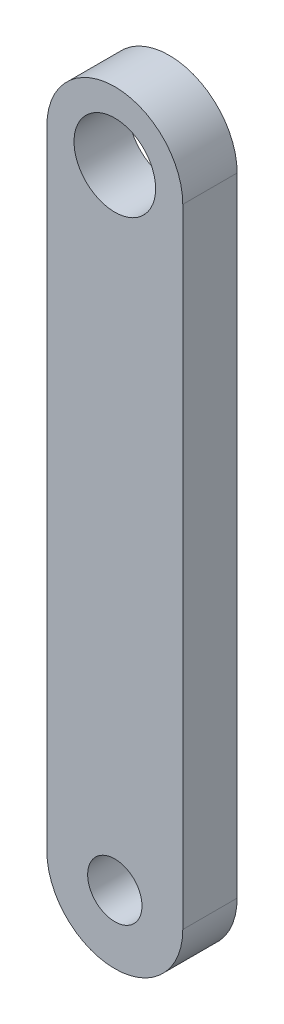
ISO-10303-21;
HEADER;
FILE_DESCRIPTION(('STEP AP214'),'2;1');
FILE_NAME('part.step','',(''),(''),'','','');
FILE_SCHEMA(('AUTOMOTIVE_DESIGN { 1 0 10303 214 1 1 1 1 }'));
ENDSEC;
DATA;
#1=APPLICATION_CONTEXT('core data for automotive mechanical design processes');
#2=APPLICATION_PROTOCOL_DEFINITION('international standard','automotive_design',2000,#1);
#3=PRODUCT_CONTEXT('',#1,'mechanical');
#4=PRODUCT('Part','Part','',(#3));
#5=PRODUCT_RELATED_PRODUCT_CATEGORY('part','',(#4));
#6=PRODUCT_DEFINITION_FORMATION('','',#4);
#7=PRODUCT_DEFINITION_CONTEXT('part definition',#1,'design');
#8=PRODUCT_DEFINITION('design','',#6,#7);
#9=PRODUCT_DEFINITION_SHAPE('','',#8);
#10=(LENGTH_UNIT() NAMED_UNIT(*) SI_UNIT(.MILLI.,.METRE.));
#11=(NAMED_UNIT(*) PLANE_ANGLE_UNIT() SI_UNIT($,.RADIAN.));
#12=(NAMED_UNIT(*) SI_UNIT($,.STERADIAN.) SOLID_ANGLE_UNIT());
#13=UNCERTAINTY_MEASURE_WITH_UNIT(LENGTH_MEASURE(1.E-05),#10,'distance_accuracy_value','');
#14=(GEOMETRIC_REPRESENTATION_CONTEXT(3) GLOBAL_UNCERTAINTY_ASSIGNED_CONTEXT((#13)) GLOBAL_UNIT_ASSIGNED_CONTEXT((#10,
#11,#12)) REPRESENTATION_CONTEXT('',''));
#15=CARTESIAN_POINT('',(0.,0.,0.));
#16=DIRECTION('',(0.,0.,1.));
#17=DIRECTION('',(1.,0.,0.));
#18=AXIS2_PLACEMENT_3D('',#15,#16,#17);
#19=CARTESIAN_POINT('',(0.,5.7746852,1.));
#20=DIRECTION('',(0.,0.,1.));
#21=DIRECTION('',(1.,0.,0.));
#22=AXIS2_PLACEMENT_3D('',#19,#20,#21);
#23=PLANE('',#22);
#24=CARTESIAN_POINT('',(0.,5.7746852,1.));
#25=DIRECTION('',(0.,0.,1.));
#26=DIRECTION('',(1.,0.,0.));
#27=AXIS2_PLACEMENT_3D('',#24,#25,#26);
#28=CIRCLE('',#27,0.75);
#29=CARTESIAN_POINT('',(0.750000000000001,5.7746852,1.));
#30=VERTEX_POINT('',#29);
#31=EDGE_CURVE('E101',#30,#30,#28,.T.);
#32=ORIENTED_EDGE('',*,*,#31,.F.);
#33=EDGE_LOOP('',(#32));
#34=FACE_BOUND('',#33,.T.);
#35=CARTESIAN_POINT('',(0.,5.7746852,1.));
#36=DIRECTION('',(0.,0.,1.));
#37=DIRECTION('',(1.,0.,0.));
#38=AXIS2_PLACEMENT_3D('',#35,#36,#37);
#39=CIRCLE('',#38,1.25);
#40=CARTESIAN_POINT('',(1.25,5.7746852,1.));
#41=VERTEX_POINT('',#40);
#42=CARTESIAN_POINT('',(-1.25,5.7746852,1.));
#43=VERTEX_POINT('',#42);
#44=EDGE_CURVE('E86',#41,#43,#39,.T.);
#45=ORIENTED_EDGE('',*,*,#44,.T.);
#46=DIRECTION('',(0.,-1.,0.));
#47=VECTOR('',#46,1.);
#48=CARTESIAN_POINT('',(-1.25,5.7746852,1.));
#49=LINE('',#48,#47);
#50=CARTESIAN_POINT('',(-1.25,-5.7746852,1.));
#51=VERTEX_POINT('',#50);
#52=EDGE_CURVE('E81',#43,#51,#49,.T.);
#53=ORIENTED_EDGE('',*,*,#52,.T.);
#54=CARTESIAN_POINT('',(0.,-5.7746852,1.));
#55=DIRECTION('',(0.,0.,1.));
#56=DIRECTION('',(-1.,0.,0.));
#57=AXIS2_PLACEMENT_3D('',#54,#55,#56);
#58=CIRCLE('',#57,1.25);
#59=CARTESIAN_POINT('',(1.25,-5.7746852,1.));
#60=VERTEX_POINT('',#59);
#61=EDGE_CURVE('E84',#51,#60,#58,.T.);
#62=ORIENTED_EDGE('',*,*,#61,.T.);
#63=DIRECTION('',(0.,1.,0.));
#64=VECTOR('',#63,1.);
#65=CARTESIAN_POINT('',(1.25,5.7746852,1.));
#66=LINE('',#65,#64);
#67=EDGE_CURVE('E51',#60,#41,#66,.T.);
#68=ORIENTED_EDGE('',*,*,#67,.T.);
#69=EDGE_LOOP('',(#45,#53,#62,#68));
#70=FACE_BOUND('',#69,.T.);
#71=CARTESIAN_POINT('',(0.,-5.7746852,1.));
#72=DIRECTION('',(0.,0.,1.));
#73=DIRECTION('',(-1.,0.,0.));
#74=AXIS2_PLACEMENT_3D('',#71,#72,#73);
#75=CIRCLE('',#74,0.5);
#76=CARTESIAN_POINT('',(-0.500000000000001,-5.7746852,1.));
#77=VERTEX_POINT('',#76);
#78=EDGE_CURVE('E116',#77,#77,#75,.T.);
#79=ORIENTED_EDGE('',*,*,#78,.F.);
#80=EDGE_LOOP('',(#79));
#81=FACE_BOUND('',#80,.T.);
#82=ADVANCED_FACE('F34',(#34,#70,#81),#23,.T.);
#83=CARTESIAN_POINT('',(0.,5.7746852,0.));
#84=DIRECTION('',(0.,0.,1.));
#85=DIRECTION('',(1.,0.,0.));
#86=AXIS2_PLACEMENT_3D('',#83,#84,#85);
#87=PLANE('',#86);
#88=CARTESIAN_POINT('',(0.,5.7746852,0.));
#89=DIRECTION('',(0.,0.,1.));
#90=DIRECTION('',(1.,0.,0.));
#91=AXIS2_PLACEMENT_3D('',#88,#89,#90);
#92=CIRCLE('',#91,1.25);
#93=CARTESIAN_POINT('',(1.25,5.7746852,0.));
#94=VERTEX_POINT('',#93);
#95=CARTESIAN_POINT('',(-1.25,5.7746852,0.));
#96=VERTEX_POINT('',#95);
#97=EDGE_CURVE('E98',#94,#96,#92,.T.);
#98=ORIENTED_EDGE('',*,*,#97,.F.);
#99=DIRECTION('',(0.,1.,0.));
#100=VECTOR('',#99,1.);
#101=CARTESIAN_POINT('',(1.25,5.7746852,0.));
#102=LINE('',#101,#100);
#103=CARTESIAN_POINT('',(1.25,-5.7746852,0.));
#104=VERTEX_POINT('',#103);
#105=EDGE_CURVE('E74',#104,#94,#102,.T.);
#106=ORIENTED_EDGE('',*,*,#105,.F.);
#107=CARTESIAN_POINT('',(0.,-5.7746852,0.));
#108=DIRECTION('',(0.,0.,1.));
#109=DIRECTION('',(-1.,0.,0.));
#110=AXIS2_PLACEMENT_3D('',#107,#108,#109);
#111=CIRCLE('',#110,1.25);
#112=CARTESIAN_POINT('',(-1.25,-5.7746852,0.));
#113=VERTEX_POINT('',#112);
#114=EDGE_CURVE('E68',#113,#104,#111,.T.);
#115=ORIENTED_EDGE('',*,*,#114,.F.);
#116=DIRECTION('',(0.,-1.,0.));
#117=VECTOR('',#116,1.);
#118=CARTESIAN_POINT('',(-1.25,5.7746852,0.));
#119=LINE('',#118,#117);
#120=EDGE_CURVE('E90',#96,#113,#119,.T.);
#121=ORIENTED_EDGE('',*,*,#120,.F.);
#122=EDGE_LOOP('',(#98,#106,#115,#121));
#123=FACE_BOUND('',#122,.T.);
#124=CARTESIAN_POINT('',(0.,5.7746852,0.));
#125=DIRECTION('',(0.,0.,1.));
#126=DIRECTION('',(1.,0.,0.));
#127=AXIS2_PLACEMENT_3D('',#124,#125,#126);
#128=CIRCLE('',#127,0.75);
#129=CARTESIAN_POINT('',(0.750000000000001,5.7746852,0.));
#130=VERTEX_POINT('',#129);
#131=EDGE_CURVE('E113',#130,#130,#128,.T.);
#132=ORIENTED_EDGE('',*,*,#131,.T.);
#133=EDGE_LOOP('',(#132));
#134=FACE_BOUND('',#133,.T.);
#135=CARTESIAN_POINT('',(0.,-5.7746852,0.));
#136=DIRECTION('',(0.,0.,1.));
#137=DIRECTION('',(-1.,0.,0.));
#138=AXIS2_PLACEMENT_3D('',#135,#136,#137);
#139=CIRCLE('',#138,0.5);
#140=CARTESIAN_POINT('',(-0.500000000000001,-5.7746852,0.));
#141=VERTEX_POINT('',#140);
#142=EDGE_CURVE('E119',#141,#141,#139,.T.);
#143=ORIENTED_EDGE('',*,*,#142,.T.);
#144=EDGE_LOOP('',(#143));
#145=FACE_BOUND('',#144,.T.);
#146=ADVANCED_FACE('F109',(#123,#134,#145),#87,.F.);
#147=CARTESIAN_POINT('',(0.,5.7746852,1.));
#148=DIRECTION('',(0.,0.,-1.));
#149=DIRECTION('',(-1.,0.,0.));
#150=AXIS2_PLACEMENT_3D('',#147,#148,#149);
#151=CYLINDRICAL_SURFACE('',#150,1.25);
#152=ORIENTED_EDGE('',*,*,#97,.T.);
#153=DIRECTION('',(0.,0.,-1.));
#154=VECTOR('',#153,1.);
#155=CARTESIAN_POINT('',(-1.25,5.7746852,1.));
#156=LINE('',#155,#154);
#157=EDGE_CURVE('E11',#43,#96,#156,.T.);
#158=ORIENTED_EDGE('',*,*,#157,.F.);
#159=ORIENTED_EDGE('',*,*,#44,.F.);
#160=DIRECTION('',(0.,0.,-1.));
#161=VECTOR('',#160,1.);
#162=CARTESIAN_POINT('',(1.25,5.7746852,1.));
#163=LINE('',#162,#161);
#164=EDGE_CURVE('E94',#41,#94,#163,.T.);
#165=ORIENTED_EDGE('',*,*,#164,.T.);
#166=EDGE_LOOP('',(#152,#158,#159,#165));
#167=FACE_BOUND('',#166,.T.);
#168=ADVANCED_FACE('F36',(#167),#151,.T.);
#169=CARTESIAN_POINT('',(-1.25,5.7746852,1.));
#170=DIRECTION('',(1.,0.,0.));
#171=DIRECTION('',(0.,0.,-1.));
#172=AXIS2_PLACEMENT_3D('',#169,#170,#171);
#173=PLANE('',#172);
#174=ORIENTED_EDGE('',*,*,#120,.T.);
#175=DIRECTION('',(0.,0.,-1.));
#176=VECTOR('',#175,1.);
#177=CARTESIAN_POINT('',(-1.25,-5.7746852,1.));
#178=LINE('',#177,#176);
#179=EDGE_CURVE('E43',#51,#113,#178,.T.);
#180=ORIENTED_EDGE('',*,*,#179,.F.);
#181=ORIENTED_EDGE('',*,*,#52,.F.);
#182=ORIENTED_EDGE('',*,*,#157,.T.);
#183=EDGE_LOOP('',(#174,#180,#181,#182));
#184=FACE_BOUND('',#183,.T.);
#185=ADVANCED_FACE('F89',(#184),#173,.F.);
#186=CARTESIAN_POINT('',(0.,-5.7746852,1.));
#187=DIRECTION('',(0.,0.,-1.));
#188=DIRECTION('',(-1.,0.,0.));
#189=AXIS2_PLACEMENT_3D('',#186,#187,#188);
#190=CYLINDRICAL_SURFACE('',#189,1.25);
#191=ORIENTED_EDGE('',*,*,#114,.T.);
#192=DIRECTION('',(0.,0.,-1.));
#193=VECTOR('',#192,1.);
#194=CARTESIAN_POINT('',(1.25,-5.7746852,1.));
#195=LINE('',#194,#193);
#196=EDGE_CURVE('E91',#60,#104,#195,.T.);
#197=ORIENTED_EDGE('',*,*,#196,.F.);
#198=ORIENTED_EDGE('',*,*,#61,.F.);
#199=ORIENTED_EDGE('',*,*,#179,.T.);
#200=EDGE_LOOP('',(#191,#197,#198,#199));
#201=FACE_BOUND('',#200,.T.);
#202=ADVANCED_FACE('F92',(#201),#190,.T.);
#203=CARTESIAN_POINT('',(1.25,5.7746852,1.));
#204=DIRECTION('',(-1.,0.,0.));
#205=DIRECTION('',(0.,0.,1.));
#206=AXIS2_PLACEMENT_3D('',#203,#204,#205);
#207=PLANE('',#206);
#208=ORIENTED_EDGE('',*,*,#105,.T.);
#209=ORIENTED_EDGE('',*,*,#164,.F.);
#210=ORIENTED_EDGE('',*,*,#67,.F.);
#211=ORIENTED_EDGE('',*,*,#196,.T.);
#212=EDGE_LOOP('',(#208,#209,#210,#211));
#213=FACE_BOUND('',#212,.T.);
#214=ADVANCED_FACE('F106',(#213),#207,.F.);
#215=CARTESIAN_POINT('',(0.,5.7746852,1.));
#216=DIRECTION('',(0.,0.,-1.));
#217=DIRECTION('',(-1.,0.,0.));
#218=AXIS2_PLACEMENT_3D('',#215,#216,#217);
#219=CYLINDRICAL_SURFACE('',#218,0.75);
#220=ORIENTED_EDGE('',*,*,#31,.T.);
#221=EDGE_LOOP('',(#220));
#222=FACE_BOUND('',#221,.T.);
#223=ORIENTED_EDGE('',*,*,#131,.F.);
#224=EDGE_LOOP('',(#223));
#225=FACE_BOUND('',#224,.T.);
#226=ADVANCED_FACE('F136',(#222,#225),#219,.F.);
#227=CARTESIAN_POINT('',(0.,-5.7746852,1.));
#228=DIRECTION('',(0.,0.,-1.));
#229=DIRECTION('',(-1.,0.,0.));
#230=AXIS2_PLACEMENT_3D('',#227,#228,#229);
#231=CYLINDRICAL_SURFACE('',#230,0.5);
#232=ORIENTED_EDGE('',*,*,#78,.T.);
#233=EDGE_LOOP('',(#232));
#234=FACE_BOUND('',#233,.T.);
#235=ORIENTED_EDGE('',*,*,#142,.F.);
#236=EDGE_LOOP('',(#235));
#237=FACE_BOUND('',#236,.T.);
#238=ADVANCED_FACE('F125',(#234,#237),#231,.F.);
#239=CLOSED_SHELL('',(#82,#146,#168,#185,#202,#214,#226,#238));
#240=MANIFOLD_SOLID_BREP('B2',#239);
#241=ADVANCED_BREP_SHAPE_REPRESENTATION('',(#18,#240),#14);
#242=SHAPE_DEFINITION_REPRESENTATION(#9,#241);
ENDSEC;
END-ISO-10303-21;
